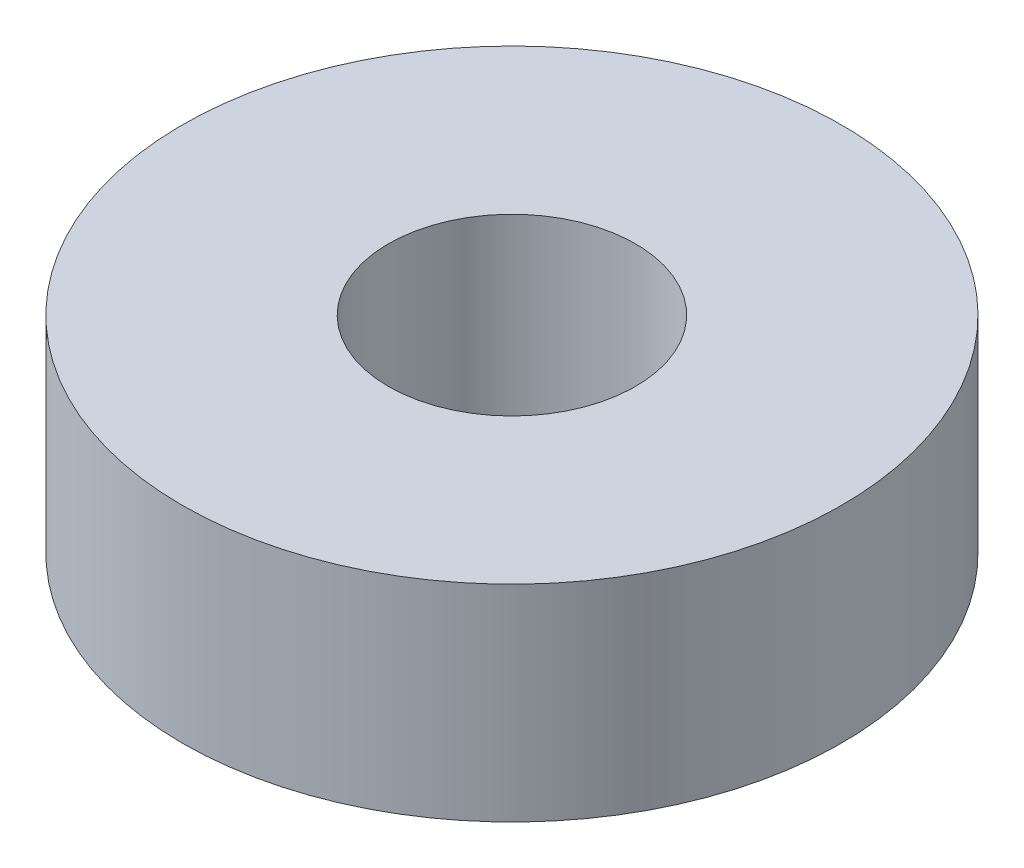
ISO-10303-21;
HEADER;
FILE_DESCRIPTION(('STEP AP214'),'2;1');
FILE_NAME('part.step','',(''),(''),'','','');
FILE_SCHEMA(('AUTOMOTIVE_DESIGN { 1 0 10303 214 1 1 1 1 }'));
ENDSEC;
DATA;
#1=APPLICATION_CONTEXT('core data for automotive mechanical design processes');
#2=APPLICATION_PROTOCOL_DEFINITION('international standard','automotive_design',2000,#1);
#3=PRODUCT_CONTEXT('',#1,'mechanical');
#4=PRODUCT('Part','Part','',(#3));
#5=PRODUCT_RELATED_PRODUCT_CATEGORY('part','',(#4));
#6=PRODUCT_DEFINITION_FORMATION('','',#4);
#7=PRODUCT_DEFINITION_CONTEXT('part definition',#1,'design');
#8=PRODUCT_DEFINITION('design','',#6,#7);
#9=PRODUCT_DEFINITION_SHAPE('','',#8);
#10=(LENGTH_UNIT() NAMED_UNIT(*) SI_UNIT(.MILLI.,.METRE.));
#11=(NAMED_UNIT(*) PLANE_ANGLE_UNIT() SI_UNIT($,.RADIAN.));
#12=(NAMED_UNIT(*) SI_UNIT($,.STERADIAN.) SOLID_ANGLE_UNIT());
#13=UNCERTAINTY_MEASURE_WITH_UNIT(LENGTH_MEASURE(1.E-05),#10,'distance_accuracy_value','');
#14=(GEOMETRIC_REPRESENTATION_CONTEXT(3) GLOBAL_UNCERTAINTY_ASSIGNED_CONTEXT((#13)) GLOBAL_UNIT_ASSIGNED_CONTEXT((#10,
#11,#12)) REPRESENTATION_CONTEXT('',''));
#15=CARTESIAN_POINT('',(0.,0.,0.));
#16=DIRECTION('',(0.,0.,1.));
#17=DIRECTION('',(1.,0.,0.));
#18=AXIS2_PLACEMENT_3D('',#15,#16,#17);
#19=CARTESIAN_POINT('',(0.,25.,0.));
#20=DIRECTION('',(0.,-1.,0.));
#21=DIRECTION('',(0.,0.,-1.));
#22=AXIS2_PLACEMENT_3D('',#19,#20,#21);
#23=CYLINDRICAL_SURFACE('',#22,40.);
#24=CARTESIAN_POINT('',(0.,25.,0.));
#25=DIRECTION('',(0.,1.,0.));
#26=DIRECTION('',(0.,0.,1.));
#27=AXIS2_PLACEMENT_3D('',#24,#25,#26);
#28=CIRCLE('',#27,40.);
#29=CARTESIAN_POINT('',(0.,25.,40.));
#30=VERTEX_POINT('',#29);
#31=EDGE_CURVE('E10',#30,#30,#28,.T.);
#32=ORIENTED_EDGE('',*,*,#31,.F.);
#33=EDGE_LOOP('',(#32));
#34=FACE_BOUND('',#33,.T.);
#35=CARTESIAN_POINT('',(0.,0.,0.));
#36=DIRECTION('',(0.,1.,0.));
#37=DIRECTION('',(0.,0.,1.));
#38=AXIS2_PLACEMENT_3D('',#35,#36,#37);
#39=CIRCLE('',#38,40.);
#40=CARTESIAN_POINT('',(0.,0.,40.));
#41=VERTEX_POINT('',#40);
#42=EDGE_CURVE('E37',#41,#41,#39,.T.);
#43=ORIENTED_EDGE('',*,*,#42,.T.);
#44=EDGE_LOOP('',(#43));
#45=FACE_BOUND('',#44,.T.);
#46=ADVANCED_FACE('F40',(#34,#45),#23,.T.);
#47=CARTESIAN_POINT('',(0.,25.,0.));
#48=DIRECTION('',(0.,1.,0.));
#49=DIRECTION('',(0.,0.,1.));
#50=AXIS2_PLACEMENT_3D('',#47,#48,#49);
#51=PLANE('',#50);
#52=CARTESIAN_POINT('',(0.,25.,0.));
#53=DIRECTION('',(0.,1.,0.));
#54=DIRECTION('',(0.,0.,1.));
#55=AXIS2_PLACEMENT_3D('',#52,#53,#54);
#56=CIRCLE('',#55,15.);
#57=CARTESIAN_POINT('',(0.,25.,15.));
#58=VERTEX_POINT('',#57);
#59=EDGE_CURVE('E50',#58,#58,#56,.T.);
#60=ORIENTED_EDGE('',*,*,#59,.F.);
#61=EDGE_LOOP('',(#60));
#62=FACE_BOUND('',#61,.T.);
#63=ORIENTED_EDGE('',*,*,#31,.T.);
#64=EDGE_LOOP('',(#63));
#65=FACE_BOUND('',#64,.T.);
#66=ADVANCED_FACE('F59',(#62,#65),#51,.T.);
#67=CARTESIAN_POINT('',(0.,0.,0.));
#68=DIRECTION('',(0.,1.,0.));
#69=DIRECTION('',(0.,0.,1.));
#70=AXIS2_PLACEMENT_3D('',#67,#68,#69);
#71=PLANE('',#70);
#72=CARTESIAN_POINT('',(0.,0.,0.));
#73=DIRECTION('',(0.,1.,0.));
#74=DIRECTION('',(0.,0.,1.));
#75=AXIS2_PLACEMENT_3D('',#72,#73,#74);
#76=CIRCLE('',#75,15.);
#77=CARTESIAN_POINT('',(0.,0.,15.));
#78=VERTEX_POINT('',#77);
#79=EDGE_CURVE('E47',#78,#78,#76,.T.);
#80=ORIENTED_EDGE('',*,*,#79,.T.);
#81=EDGE_LOOP('',(#80));
#82=FACE_BOUND('',#81,.T.);
#83=ORIENTED_EDGE('',*,*,#42,.F.);
#84=EDGE_LOOP('',(#83));
#85=FACE_BOUND('',#84,.T.);
#86=ADVANCED_FACE('F58',(#82,#85),#71,.F.);
#87=CARTESIAN_POINT('',(0.,25.,0.));
#88=DIRECTION('',(0.,-1.,0.));
#89=DIRECTION('',(0.,0.,-1.));
#90=AXIS2_PLACEMENT_3D('',#87,#88,#89);
#91=CYLINDRICAL_SURFACE('',#90,15.);
#92=ORIENTED_EDGE('',*,*,#59,.T.);
#93=EDGE_LOOP('',(#92));
#94=FACE_BOUND('',#93,.T.);
#95=ORIENTED_EDGE('',*,*,#79,.F.);
#96=EDGE_LOOP('',(#95));
#97=FACE_BOUND('',#96,.T.);
#98=ADVANCED_FACE('F54',(#94,#97),#91,.F.);
#99=CLOSED_SHELL('',(#46,#66,#86,#98));
#100=MANIFOLD_SOLID_BREP('B2',#99);
#101=ADVANCED_BREP_SHAPE_REPRESENTATION('',(#18,#100),#14);
#102=SHAPE_DEFINITION_REPRESENTATION(#9,#101);
ENDSEC;
END-ISO-10303-21;
